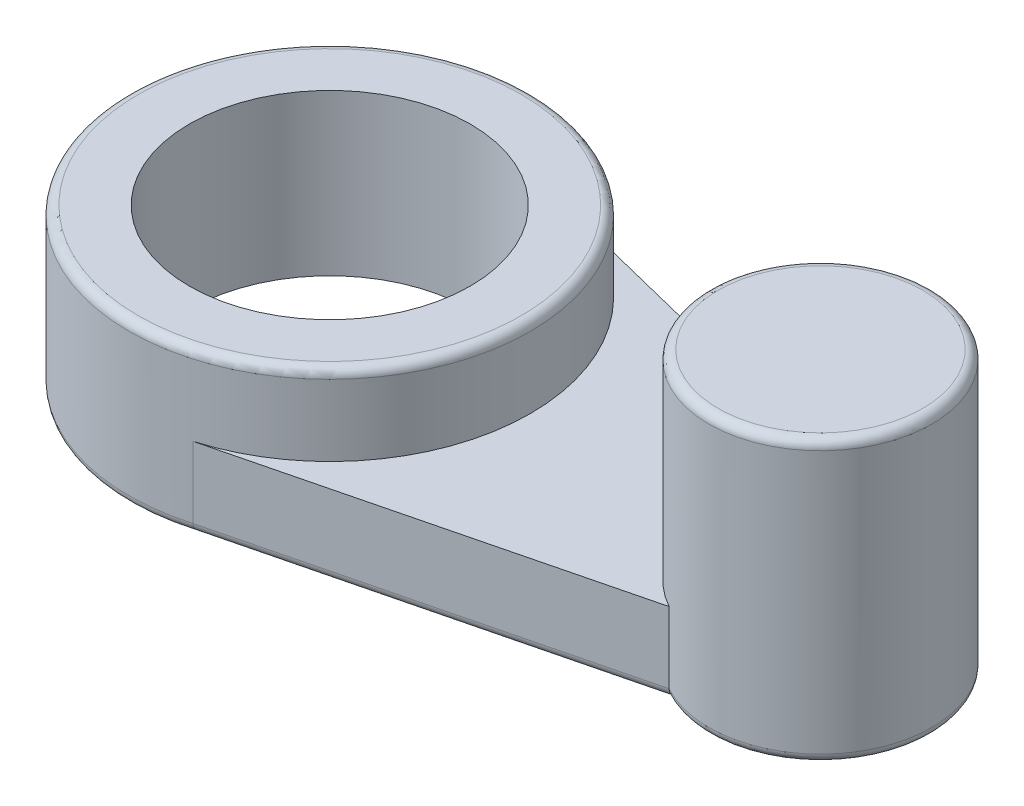
ISO-10303-21;
HEADER;
FILE_DESCRIPTION(('STEP AP214'),'2;1');
FILE_NAME('part.step','',(''),(''),'','','');
FILE_SCHEMA(('AUTOMOTIVE_DESIGN { 1 0 10303 214 1 1 1 1 }'));
ENDSEC;
DATA;
#1=APPLICATION_CONTEXT('core data for automotive mechanical design processes');
#2=APPLICATION_PROTOCOL_DEFINITION('international standard','automotive_design',2000,#1);
#3=PRODUCT_CONTEXT('',#1,'mechanical');
#4=PRODUCT('Part','Part','',(#3));
#5=PRODUCT_RELATED_PRODUCT_CATEGORY('part','',(#4));
#6=PRODUCT_DEFINITION_FORMATION('','',#4);
#7=PRODUCT_DEFINITION_CONTEXT('part definition',#1,'design');
#8=PRODUCT_DEFINITION('design','',#6,#7);
#9=PRODUCT_DEFINITION_SHAPE('','',#8);
#10=(LENGTH_UNIT() NAMED_UNIT(*) SI_UNIT(.MILLI.,.METRE.));
#11=(NAMED_UNIT(*) PLANE_ANGLE_UNIT() SI_UNIT($,.RADIAN.));
#12=(NAMED_UNIT(*) SI_UNIT($,.STERADIAN.) SOLID_ANGLE_UNIT());
#13=UNCERTAINTY_MEASURE_WITH_UNIT(LENGTH_MEASURE(1.E-05),#10,'distance_accuracy_value','');
#14=(GEOMETRIC_REPRESENTATION_CONTEXT(3) GLOBAL_UNCERTAINTY_ASSIGNED_CONTEXT((#13)) GLOBAL_UNIT_ASSIGNED_CONTEXT((#10,
#11,#12)) REPRESENTATION_CONTEXT('',''));
#15=CARTESIAN_POINT('',(0.,0.,0.));
#16=DIRECTION('',(0.,0.,1.));
#17=DIRECTION('',(1.,0.,0.));
#18=AXIS2_PLACEMENT_3D('',#15,#16,#17);
#19=CARTESIAN_POINT('',(-11.9959957868635,23.4129631518981,0.));
#20=DIRECTION('',(0.,-1.,0.));
#21=DIRECTION('',(0.,0.,-1.));
#22=AXIS2_PLACEMENT_3D('',#19,#20,#21);
#23=CYLINDRICAL_SURFACE('',#22,6.13214349395014);
#24=CARTESIAN_POINT('',(-11.9959957868635,33.9529631518981,0.));
#25=DIRECTION('',(0.,-1.,0.));
#26=DIRECTION('',(0.,0.,-1.));
#27=AXIS2_PLACEMENT_3D('',#24,#25,#26);
#28=CIRCLE('',#27,6.13214349395014);
#29=CARTESIAN_POINT('',(-11.9959957868635,33.9529631518981,-6.13214349395014));
#30=VERTEX_POINT('',#29);
#31=EDGE_CURVE('E137',#30,#30,#28,.T.);
#32=ORIENTED_EDGE('',*,*,#31,.T.);
#33=EDGE_LOOP('',(#32));
#34=FACE_BOUND('',#33,.T.);
#35=DIRECTION('',(0.,-1.,0.));
#36=VECTOR('',#35,1.);
#37=CARTESIAN_POINT('',(-14.9421293152847,23.4129631518981,5.37805550948547));
#38=LINE('',#37,#36);
#39=CARTESIAN_POINT('',(-14.9421293152847,23.4129631518981,5.37805550948547));
#40=VERTEX_POINT('',#39);
#41=CARTESIAN_POINT('',(-14.9421293152847,19.4969631518981,5.37805550948547));
#42=VERTEX_POINT('',#41);
#43=EDGE_CURVE('E116',#40,#42,#38,.T.);
#44=ORIENTED_EDGE('',*,*,#43,.T.);
#45=CARTESIAN_POINT('',(-11.9959957868635,19.4969631518981,0.));
#46=DIRECTION('',(0.,1.,0.));
#47=DIRECTION('',(0.,0.,1.));
#48=AXIS2_PLACEMENT_3D('',#45,#46,#47);
#49=CIRCLE('',#48,6.13214349395014);
#50=CARTESIAN_POINT('',(-14.9421293152847,19.4969631518981,-5.37805550948547));
#51=VERTEX_POINT('',#50);
#52=EDGE_CURVE('E114',#42,#51,#49,.T.);
#53=ORIENTED_EDGE('',*,*,#52,.T.);
#54=DIRECTION('',(0.,-1.,0.));
#55=VECTOR('',#54,1.);
#56=CARTESIAN_POINT('',(-14.9421293152847,23.4129631518981,-5.37805550948547));
#57=LINE('',#56,#55);
#58=CARTESIAN_POINT('',(-14.9421293152847,23.4129631518981,-5.37805550948547));
#59=VERTEX_POINT('',#58);
#60=EDGE_CURVE('E99',#59,#51,#57,.T.);
#61=ORIENTED_EDGE('',*,*,#60,.F.);
#62=CARTESIAN_POINT('',(-11.9959957868635,23.4129631518981,0.));
#63=DIRECTION('',(0.,1.,0.));
#64=DIRECTION('',(0.,0.,1.));
#65=AXIS2_PLACEMENT_3D('',#62,#63,#64);
#66=CIRCLE('',#65,6.13214349395013);
#67=EDGE_CURVE('E112',#59,#40,#66,.T.);
#68=ORIENTED_EDGE('',*,*,#67,.T.);
#69=EDGE_LOOP('',(#44,#53,#61,#68));
#70=FACE_BOUND('',#69,.T.);
#71=ADVANCED_FACE('F37',(#34,#70),#23,.T.);
#72=CARTESIAN_POINT('',(-17.8664003133708,23.4129631518981,-6.10644323168723));
#73=DIRECTION('',(0.241698542021081,0.,-0.970351387274158));
#74=DIRECTION('',(-0.970351387274158,0.,-0.241698542021081));
#75=AXIS2_PLACEMENT_3D('',#72,#73,#74);
#76=PLANE('',#75);
#77=ORIENTED_EDGE('',*,*,#60,.T.);
#78=DIRECTION('',(0.970351387274158,0.,0.241698542021081));
#79=VECTOR('',#78,1.);
#80=CARTESIAN_POINT('',(-35.9101707163184,19.4969631518981,-10.6008491305716));
#81=LINE('',#80,#79);
#82=CARTESIAN_POINT('',(-35.9101707163185,19.4969631518981,-10.6008491305716));
#83=VERTEX_POINT('',#82);
#84=EDGE_CURVE('E133',#51,#83,#81,.F.);
#85=ORIENTED_EDGE('',*,*,#84,.T.);
#86=DIRECTION('',(0.,-1.,0.));
#87=VECTOR('',#86,1.);
#88=CARTESIAN_POINT('',(-35.9101707163185,27.8289631518981,-10.6008491305716));
#89=LINE('',#88,#87);
#90=CARTESIAN_POINT('',(-35.9101707163184,23.4129631518981,-10.6008491305716));
#91=VERTEX_POINT('',#90);
#92=EDGE_CURVE('E102',#91,#83,#89,.T.);
#93=ORIENTED_EDGE('',*,*,#92,.F.);
#94=DIRECTION('',(0.970351387274158,0.,0.241698542021081));
#95=VECTOR('',#94,1.);
#96=CARTESIAN_POINT('',(-17.8664003133708,23.4129631518981,-6.10644323168723));
#97=LINE('',#96,#95);
#98=EDGE_CURVE('E95',#91,#59,#97,.T.);
#99=ORIENTED_EDGE('',*,*,#98,.T.);
#100=EDGE_LOOP('',(#77,#85,#93,#99));
#101=FACE_BOUND('',#100,.T.);
#102=ADVANCED_FACE('F97',(#101),#76,.T.);
#103=CARTESIAN_POINT('',(-38.9929612883262,23.4129631518981,0.));
#104=DIRECTION('',(0.,-1.,0.));
#105=DIRECTION('',(0.,0.,-1.));
#106=AXIS2_PLACEMENT_3D('',#103,#104,#105);
#107=CYLINDRICAL_SURFACE('',#106,11.04);
#108=CARTESIAN_POINT('',(-38.9929612883262,27.3289631518981,0.));
#109=DIRECTION('',(0.,-1.,0.));
#110=DIRECTION('',(0.,0.,-1.));
#111=AXIS2_PLACEMENT_3D('',#108,#109,#110);
#112=CIRCLE('',#111,11.04);
#113=CARTESIAN_POINT('',(-38.9929612883262,27.3289631518981,-11.04));
#114=VERTEX_POINT('',#113);
#115=EDGE_CURVE('E144',#114,#114,#112,.T.);
#116=ORIENTED_EDGE('',*,*,#115,.T.);
#117=EDGE_LOOP('',(#116));
#118=FACE_BOUND('',#117,.T.);
#119=ORIENTED_EDGE('',*,*,#92,.T.);
#120=CARTESIAN_POINT('',(-38.9929612883262,19.4969631518981,0.));
#121=DIRECTION('',(0.,1.,0.));
#122=DIRECTION('',(0.,0.,1.));
#123=AXIS2_PLACEMENT_3D('',#120,#121,#122);
#124=CIRCLE('',#123,11.04);
#125=CARTESIAN_POINT('',(-35.9101707163185,19.4969631518981,10.6008491305716));
#126=VERTEX_POINT('',#125);
#127=EDGE_CURVE('E150',#83,#126,#124,.T.);
#128=ORIENTED_EDGE('',*,*,#127,.T.);
#129=DIRECTION('',(0.,-1.,0.));
#130=VECTOR('',#129,1.);
#131=CARTESIAN_POINT('',(-35.9101707163185,27.8289631518981,10.6008491305716));
#132=LINE('',#131,#130);
#133=CARTESIAN_POINT('',(-35.9101707163184,23.4129631518981,10.6008491305716));
#134=VERTEX_POINT('',#133);
#135=EDGE_CURVE('E124',#134,#126,#132,.T.);
#136=ORIENTED_EDGE('',*,*,#135,.F.);
#137=CARTESIAN_POINT('',(-38.9929612883262,23.4129631518981,0.));
#138=DIRECTION('',(0.,1.,0.));
#139=DIRECTION('',(0.,0.,1.));
#140=AXIS2_PLACEMENT_3D('',#137,#138,#139);
#141=CIRCLE('',#140,11.04);
#142=EDGE_CURVE('E197',#134,#91,#141,.T.);
#143=ORIENTED_EDGE('',*,*,#142,.T.);
#144=EDGE_LOOP('',(#119,#128,#136,#143));
#145=FACE_BOUND('',#144,.T.);
#146=ADVANCED_FACE('F191',(#118,#145),#107,.T.);
#147=CARTESIAN_POINT('',(-17.8664003133708,23.4129631518981,6.10644323168723));
#148=DIRECTION('',(-0.241698542021081,0.,-0.970351387274158));
#149=DIRECTION('',(-0.970351387274158,0.,0.241698542021081));
#150=AXIS2_PLACEMENT_3D('',#147,#148,#149);
#151=PLANE('',#150);
#152=ORIENTED_EDGE('',*,*,#135,.T.);
#153=DIRECTION('',(0.970351387274158,0.,-0.241698542021081));
#154=VECTOR('',#153,1.);
#155=CARTESIAN_POINT('',(-17.8664003133708,19.4969631518981,6.10644323168723));
#156=LINE('',#155,#154);
#157=EDGE_CURVE('E135',#126,#42,#156,.T.);
#158=ORIENTED_EDGE('',*,*,#157,.T.);
#159=ORIENTED_EDGE('',*,*,#43,.F.);
#160=DIRECTION('',(0.970351387274158,0.,-0.241698542021081));
#161=VECTOR('',#160,1.);
#162=CARTESIAN_POINT('',(-17.8664003133708,23.4129631518981,6.10644323168723));
#163=LINE('',#162,#161);
#164=EDGE_CURVE('E106',#134,#40,#163,.T.);
#165=ORIENTED_EDGE('',*,*,#164,.F.);
#166=EDGE_LOOP('',(#152,#158,#159,#165));
#167=FACE_BOUND('',#166,.T.);
#168=ADVANCED_FACE('F196',(#167),#151,.F.);
#169=CARTESIAN_POINT('',(-38.9929612883262,23.4129631518981,0.));
#170=DIRECTION('',(0.,-1.,0.));
#171=DIRECTION('',(0.,0.,-1.));
#172=AXIS2_PLACEMENT_3D('',#169,#170,#171);
#173=CYLINDRICAL_SURFACE('',#172,7.728);
#174=CARTESIAN_POINT('',(-38.9929612883262,18.9969631518981,0.));
#175=DIRECTION('',(0.,1.,0.));
#176=DIRECTION('',(0.,0.,1.));
#177=AXIS2_PLACEMENT_3D('',#174,#175,#176);
#178=CIRCLE('',#177,7.728);
#179=CARTESIAN_POINT('',(-38.9929612883262,18.9969631518981,7.728));
#180=VERTEX_POINT('',#179);
#181=EDGE_CURVE('E107',#180,#180,#178,.T.);
#182=ORIENTED_EDGE('',*,*,#181,.F.);
#183=EDGE_LOOP('',(#182));
#184=FACE_BOUND('',#183,.T.);
#185=CARTESIAN_POINT('',(-38.9929612883262,27.8289631518981,0.));
#186=DIRECTION('',(0.,-1.,0.));
#187=DIRECTION('',(0.,0.,-1.));
#188=AXIS2_PLACEMENT_3D('',#185,#186,#187);
#189=CIRCLE('',#188,7.72800000000001);
#190=CARTESIAN_POINT('',(-38.9929612883262,27.8289631518981,-7.72800000000001));
#191=VERTEX_POINT('',#190);
#192=EDGE_CURVE('E203',#191,#191,#189,.T.);
#193=ORIENTED_EDGE('',*,*,#192,.F.);
#194=EDGE_LOOP('',(#193));
#195=FACE_BOUND('',#194,.T.);
#196=ADVANCED_FACE('F212',(#184,#195),#173,.F.);
#197=CARTESIAN_POINT('',(-19.3874147060841,23.4129631518981,0.));
#198=DIRECTION('',(0.,1.,0.));
#199=DIRECTION('',(0.,0.,1.));
#200=AXIS2_PLACEMENT_3D('',#197,#198,#199);
#201=PLANE('',#200);
#202=ORIENTED_EDGE('',*,*,#142,.F.);
#203=ORIENTED_EDGE('',*,*,#164,.T.);
#204=ORIENTED_EDGE('',*,*,#67,.F.);
#205=ORIENTED_EDGE('',*,*,#98,.F.);
#206=EDGE_LOOP('',(#202,#203,#204,#205));
#207=FACE_BOUND('',#206,.T.);
#208=ADVANCED_FACE('F118',(#207),#201,.T.);
#209=CARTESIAN_POINT('',(-19.3874147060841,18.9969631518981,0.));
#210=DIRECTION('',(0.,1.,0.));
#211=DIRECTION('',(0.,0.,1.));
#212=AXIS2_PLACEMENT_3D('',#209,#210,#211);
#213=PLANE('',#212);
#214=DIRECTION('',(0.970351387274158,0.,-0.241698542021081));
#215=VECTOR('',#214,1.);
#216=CARTESIAN_POINT('',(-17.9872495843814,18.9969631518981,5.62126753805015));
#217=LINE('',#216,#215);
#218=CARTESIAN_POINT('',(-14.8686441965292,18.9969631518981,4.84447432141917));
#219=VERTEX_POINT('',#218);
#220=CARTESIAN_POINT('',(-36.040563512861,18.9969631518981,10.1180505718951));
#221=VERTEX_POINT('',#220);
#222=EDGE_CURVE('E58',#219,#221,#217,.F.);
#223=ORIENTED_EDGE('',*,*,#222,.T.);
#224=CARTESIAN_POINT('',(-38.9929612883262,18.9969631518981,0.));
#225=DIRECTION('',(0.,1.,0.));
#226=DIRECTION('',(0.,0.,1.));
#227=AXIS2_PLACEMENT_3D('',#224,#225,#226);
#228=CIRCLE('',#227,10.54);
#229=CARTESIAN_POINT('',(-36.040563512861,18.9969631518981,-10.1180505718952));
#230=VERTEX_POINT('',#229);
#231=EDGE_CURVE('E185',#221,#230,#228,.F.);
#232=ORIENTED_EDGE('',*,*,#231,.T.);
#233=DIRECTION('',(0.970351387274158,0.,0.241698542021081));
#234=VECTOR('',#233,1.);
#235=CARTESIAN_POINT('',(-15.0629785862953,18.9969631518981,-4.8928798158484));
#236=LINE('',#235,#234);
#237=CARTESIAN_POINT('',(-14.8686441965292,18.9969631518981,-4.84447432141918));
#238=VERTEX_POINT('',#237);
#239=EDGE_CURVE('E65',#230,#238,#236,.T.);
#240=ORIENTED_EDGE('',*,*,#239,.T.);
#241=CARTESIAN_POINT('',(-11.9959957868635,18.9969631518981,0.));
#242=DIRECTION('',(0.,1.,0.));
#243=DIRECTION('',(0.,0.,1.));
#244=AXIS2_PLACEMENT_3D('',#241,#242,#243);
#245=CIRCLE('',#244,5.63214349395014);
#246=EDGE_CURVE('E115',#238,#219,#245,.F.);
#247=ORIENTED_EDGE('',*,*,#246,.T.);
#248=EDGE_LOOP('',(#223,#232,#240,#247));
#249=FACE_BOUND('',#248,.T.);
#250=ORIENTED_EDGE('',*,*,#181,.T.);
#251=EDGE_LOOP('',(#250));
#252=FACE_BOUND('',#251,.T.);
#253=ADVANCED_FACE('F205',(#249,#252),#213,.F.);
#254=CARTESIAN_POINT('',(-11.9959957868635,34.4529631518981,0.));
#255=DIRECTION('',(0.,-1.,0.));
#256=DIRECTION('',(0.,0.,-1.));
#257=AXIS2_PLACEMENT_3D('',#254,#255,#256);
#258=PLANE('',#257);
#259=CARTESIAN_POINT('',(-11.9959957868635,34.4529631518981,0.));
#260=DIRECTION('',(0.,-1.,0.));
#261=DIRECTION('',(0.,0.,-1.));
#262=AXIS2_PLACEMENT_3D('',#259,#260,#261);
#263=CIRCLE('',#262,5.63214349395014);
#264=CARTESIAN_POINT('',(-11.9959957868635,34.4529631518981,-5.63214349395014));
#265=VERTEX_POINT('',#264);
#266=EDGE_CURVE('E141',#265,#265,#263,.F.);
#267=ORIENTED_EDGE('',*,*,#266,.T.);
#268=EDGE_LOOP('',(#267));
#269=FACE_BOUND('',#268,.T.);
#270=ADVANCED_FACE('F208',(#269),#258,.F.);
#271=CARTESIAN_POINT('',(-38.9929612883262,27.8289631518981,0.));
#272=DIRECTION('',(0.,-1.,0.));
#273=DIRECTION('',(0.,0.,-1.));
#274=AXIS2_PLACEMENT_3D('',#271,#272,#273);
#275=PLANE('',#274);
#276=CARTESIAN_POINT('',(-38.9929612883262,27.8289631518981,0.));
#277=DIRECTION('',(0.,-1.,0.));
#278=DIRECTION('',(0.,0.,-1.));
#279=AXIS2_PLACEMENT_3D('',#276,#277,#278);
#280=CIRCLE('',#279,10.54);
#281=CARTESIAN_POINT('',(-38.9929612883262,27.8289631518981,-10.54));
#282=VERTEX_POINT('',#281);
#283=EDGE_CURVE('E147',#282,#282,#280,.F.);
#284=ORIENTED_EDGE('',*,*,#283,.T.);
#285=EDGE_LOOP('',(#284));
#286=FACE_BOUND('',#285,.T.);
#287=ORIENTED_EDGE('',*,*,#192,.T.);
#288=EDGE_LOOP('',(#287));
#289=FACE_BOUND('',#288,.T.);
#290=ADVANCED_FACE('F177',(#286,#289),#275,.F.);
#291=CARTESIAN_POINT('',(-17.9872495843814,19.4969631518981,5.62126753805015));
#292=DIRECTION('',(0.970351387274158,0.,-0.241698542021081));
#293=DIRECTION('',(-0.241698542021081,0.,-0.970351387274158));
#294=AXIS2_PLACEMENT_3D('',#291,#292,#293);
#295=CYLINDRICAL_SURFACE('',#294,0.5);
#296=ORIENTED_EDGE('',*,*,#157,.F.);
#297=CARTESIAN_POINT('',(-35.9101707163185,19.4969631518981,10.6008491305716));
#298=CARTESIAN_POINT('',(-35.9101645152855,19.4688389592666,10.6008722261111));
#299=CARTESIAN_POINT('',(-35.9107886454514,19.440721928932,10.5985591092982));
#300=CARTESIAN_POINT('',(-35.9132518992034,19.3853027745455,10.5894305452488));
#301=CARTESIAN_POINT('',(-35.9150901556804,19.3580000834397,10.5826183112084));
#302=CARTESIAN_POINT('',(-35.9199372763439,19.3049550987381,10.564656849425));
#303=CARTESIAN_POINT('',(-35.9229467023454,19.2792135608944,10.5535055402094));
#304=CARTESIAN_POINT('',(-35.9300481530671,19.2300408970086,10.5271936125944));
#305=CARTESIAN_POINT('',(-35.9341399025548,19.2066091856591,10.5120340134949));
#306=CARTESIAN_POINT('',(-35.9432910860418,19.1627136331812,10.4781331574344));
#307=CARTESIAN_POINT('',(-35.9483505217494,19.1422497972923,10.4593918941506));
#308=CARTESIAN_POINT('',(-35.9592964906778,19.1048621725398,10.4188505764742));
#309=CARTESIAN_POINT('',(-35.965183368491,19.0879398659096,10.397049247707));
#310=CARTESIAN_POINT('',(-35.977618410301,19.0581178071183,10.3510039142472));
#311=CARTESIAN_POINT('',(-35.9841669648904,19.0452204494951,10.3267584667935));
#312=CARTESIAN_POINT('',(-35.9977331694352,19.0238392752297,10.2765382719137));
#313=CARTESIAN_POINT('',(-36.0047502259477,19.0153499903215,10.2505657123505));
#314=CARTESIAN_POINT('',(-36.0156475198088,19.0059413533125,10.2102373208144));
#315=CARTESIAN_POINT('',(-36.0194337024368,19.0033417934835,10.1962266372921));
#316=CARTESIAN_POINT('',(-36.0270485799872,18.9994348366223,10.168050264231));
#317=CARTESIAN_POINT('',(-36.0308772189556,18.9981259055311,10.1538847789996));
#318=CARTESIAN_POINT('',(-36.0366619977869,18.9971305056127,10.1324835875125));
#319=CARTESIAN_POINT('',(-36.0386129272005,18.9969626826829,10.1252662904109));
#320=CARTESIAN_POINT('',(-36.040563512861,18.9969631518981,10.1180505718952));
#321=B_SPLINE_CURVE_WITH_KNOTS('',3,(#297,#298,#299,#300,#301,#302,#303,#304,#305,#306,#307,
#308,#309,#310,#311,#312,#313,#314,#315,#316,#317,#318,#319,#320),.UNSPECIFIED.,.F.,.F.,(4,2,2,
2,2,2,2,2,2,2,2,4),(0.,0.0842604497592894,0.168460787060122,0.252701565512898,0.336920942279963,
0.421140467725503,0.505395171318541,0.589699904904091,0.673899806117333,0.718085190014083,
0.762217991020712,0.784644342041857),.UNSPECIFIED.);
#322=EDGE_CURVE('E51',#126,#221,#321,.T.);
#323=ORIENTED_EDGE('',*,*,#322,.T.);
#324=ORIENTED_EDGE('',*,*,#222,.F.);
#325=CARTESIAN_POINT('',(-14.9421293152847,19.4969631518981,5.37805550948547));
#326=CARTESIAN_POINT('',(-14.942132414396,19.4702397058806,5.37808665234147));
#327=CARTESIAN_POINT('',(-14.9418347620113,19.4435341733236,5.37577633459494));
#328=CARTESIAN_POINT('',(-14.9406623908897,19.3909681460324,5.3667153748242));
#329=CARTESIAN_POINT('',(-14.9397891545153,19.3651056591979,5.35997613919286));
#330=CARTESIAN_POINT('',(-14.937490028429,19.3148945795701,5.34229923668067));
#331=CARTESIAN_POINT('',(-14.9360642344701,19.2905457253267,5.33136229722466));
#332=CARTESIAN_POINT('',(-14.9327009615045,19.2439724438483,5.30569963079664));
#333=CARTESIAN_POINT('',(-14.9307633290477,19.221748656438,5.29097276763296));
#334=CARTESIAN_POINT('',(-14.9263665735765,19.1793601971849,5.25777029763611));
#335=CARTESIAN_POINT('',(-14.9238945358943,19.1592692666195,5.23920246124084));
#336=CARTESIAN_POINT('',(-14.918524209504,19.1222815166439,5.19917401836872));
#337=CARTESIAN_POINT('',(-14.915625782621,19.1053857367192,5.17771247435199));
#338=CARTESIAN_POINT('',(-14.9092673428912,19.0740961343528,5.13103018011629));
#339=CARTESIAN_POINT('',(-14.9057830457651,19.0599370134079,5.10565561480322));
#340=CARTESIAN_POINT('',(-14.8984855504529,19.0358054009119,5.05302901618352));
#341=CARTESIAN_POINT('',(-14.8946722661009,19.0258340102185,5.02577649139355));
#342=CARTESIAN_POINT('',(-14.8873267491247,19.0112483051626,4.97381288448704));
#343=CARTESIAN_POINT('',(-14.8838244661816,19.0060983402533,4.94924506679531));
#344=CARTESIAN_POINT('',(-14.8766971594922,18.9990864040659,4.89969589503425));
#345=CARTESIAN_POINT('',(-14.8730723855781,18.9972181086181,4.87471543021781));
#346=CARTESIAN_POINT('',(-14.8691598616366,18.9969712503272,4.84799297083337));
#347=CARTESIAN_POINT('',(-14.868902097914,18.9969631324544,4.8462335593471));
#348=CARTESIAN_POINT('',(-14.8686441965291,18.9969631518981,4.84447432141922));
#349=B_SPLINE_CURVE_WITH_KNOTS('',3,(#325,#326,#327,#328,#329,#330,#331,#332,#333,#334,#335,
#336,#337,#338,#339,#340,#341,#342,#343,#344,#345,#346,#347,#348),.UNSPECIFIED.,.F.,.F.,(4,2,2,
2,2,2,2,2,2,2,2,4),(0.,0.080041315201751,0.159877292770921,0.239699441715084,0.319545548694535,
0.40159493425082,0.483670967368172,0.571093982668611,0.658539965103093,0.734370387591143,
0.810054514791419,0.815389062425867),.UNSPECIFIED.);
#350=EDGE_CURVE('E158',#42,#219,#349,.T.);
#351=ORIENTED_EDGE('',*,*,#350,.F.);
#352=EDGE_LOOP('',(#296,#323,#324,#351));
#353=FACE_BOUND('',#352,.T.);
#354=ADVANCED_FACE('F172',(#353),#295,.T.);
#355=CARTESIAN_POINT('',(-11.9959957868635,19.4969631518981,0.));
#356=DIRECTION('',(0.,1.,0.));
#357=DIRECTION('',(0.,0.,1.));
#358=AXIS2_PLACEMENT_3D('',#355,#356,#357);
#359=TOROIDAL_SURFACE('',#358,5.63214349395014,0.5);
#360=ORIENTED_EDGE('',*,*,#350,.T.);
#361=ORIENTED_EDGE('',*,*,#246,.F.);
#362=CARTESIAN_POINT('',(-14.9421293152847,19.4969631518981,-5.37805550948547));
#363=CARTESIAN_POINT('',(-14.942132414396,19.4702397058806,-5.37808665234148));
#364=CARTESIAN_POINT('',(-14.9418347620113,19.4435341733236,-5.37577633459494));
#365=CARTESIAN_POINT('',(-14.9406623908897,19.3909681460324,-5.3667153748242));
#366=CARTESIAN_POINT('',(-14.9397891545153,19.3651056591979,-5.35997613919286));
#367=CARTESIAN_POINT('',(-14.937490028429,19.3148945795701,-5.34229923668067));
#368=CARTESIAN_POINT('',(-14.9360642344701,19.2905457253267,-5.33136229722467));
#369=CARTESIAN_POINT('',(-14.9327009615045,19.2439724438483,-5.30569963079664));
#370=CARTESIAN_POINT('',(-14.9307633290477,19.221748656438,-5.29097276763297));
#371=CARTESIAN_POINT('',(-14.9263665735765,19.1793601971849,-5.25777029763612));
#372=CARTESIAN_POINT('',(-14.9238945358943,19.1592692666195,-5.23920246124084));
#373=CARTESIAN_POINT('',(-14.918524209504,19.1222815166439,-5.19917401836873));
#374=CARTESIAN_POINT('',(-14.915625782621,19.1053857367192,-5.17771247435199));
#375=CARTESIAN_POINT('',(-14.9092673428912,19.0740961343528,-5.13103018011629));
#376=CARTESIAN_POINT('',(-14.9057830457651,19.0599370134079,-5.10565561480322));
#377=CARTESIAN_POINT('',(-14.8984855504529,19.0358054009119,-5.05302901618352));
#378=CARTESIAN_POINT('',(-14.8946722661009,19.0258340102185,-5.02577649139356));
#379=CARTESIAN_POINT('',(-14.8873267491247,19.0112483051626,-4.97381288448705));
#380=CARTESIAN_POINT('',(-14.8838244661816,19.0060983402533,-4.94924506679532));
#381=CARTESIAN_POINT('',(-14.8766971594922,18.9990864040659,-4.89969589503426));
#382=CARTESIAN_POINT('',(-14.873072385578,18.9972181086181,-4.87471543021782));
#383=CARTESIAN_POINT('',(-14.8691598616366,18.9969712503272,-4.84799297083337));
#384=CARTESIAN_POINT('',(-14.868902097914,18.9969631324544,-4.84623355934711));
#385=CARTESIAN_POINT('',(-14.8686441965291,18.9969631518981,-4.84447432141923));
#386=B_SPLINE_CURVE_WITH_KNOTS('',3,(#362,#363,#364,#365,#366,#367,#368,#369,#370,#371,#372,
#373,#374,#375,#376,#377,#378,#379,#380,#381,#382,#383,#384,#385),.UNSPECIFIED.,.F.,.F.,(4,2,2,
2,2,2,2,2,2,2,2,4),(0.,0.080041315201751,0.159877292770921,0.239699441715087,0.31954554869454,
0.401594934250823,0.483670967368173,0.571093982668612,0.658539965103093,0.734370387591143,
0.810054514791419,0.815389062425867),.UNSPECIFIED.);
#387=EDGE_CURVE('E151',#51,#238,#386,.T.);
#388=ORIENTED_EDGE('',*,*,#387,.F.);
#389=ORIENTED_EDGE('',*,*,#52,.F.);
#390=EDGE_LOOP('',(#360,#361,#388,#389));
#391=FACE_BOUND('',#390,.T.);
#392=ADVANCED_FACE('F165',(#391),#359,.T.);
#393=CARTESIAN_POINT('',(-17.9872495843814,19.4969631518981,-5.62126753805016));
#394=DIRECTION('',(-0.970351387274158,0.,-0.241698542021081));
#395=DIRECTION('',(-0.241698542021081,0.,0.970351387274158));
#396=AXIS2_PLACEMENT_3D('',#393,#394,#395);
#397=CYLINDRICAL_SURFACE('',#396,0.5);
#398=ORIENTED_EDGE('',*,*,#239,.F.);
#399=CARTESIAN_POINT('',(-35.9101707163185,19.4969631518981,-10.6008491305716));
#400=CARTESIAN_POINT('',(-35.9101645152856,19.4688389592666,-10.6008722261111));
#401=CARTESIAN_POINT('',(-35.9107886454515,19.440721928932,-10.5985591092983));
#402=CARTESIAN_POINT('',(-35.9132518992035,19.3853027745455,-10.5894305452489));
#403=CARTESIAN_POINT('',(-35.9150901556805,19.3580000834397,-10.5826183112084));
#404=CARTESIAN_POINT('',(-35.919937276344,19.3049550987381,-10.564656849425));
#405=CARTESIAN_POINT('',(-35.9229467023455,19.2792135608944,-10.5535055402094));
#406=CARTESIAN_POINT('',(-35.9300481530672,19.2300408970086,-10.5271936125945));
#407=CARTESIAN_POINT('',(-35.9341399025547,19.2066091856591,-10.5120340134949));
#408=CARTESIAN_POINT('',(-35.9432910860417,19.1627136331812,-10.4781331574344));
#409=CARTESIAN_POINT('',(-35.9483505217495,19.1422497972923,-10.4593918941506));
#410=CARTESIAN_POINT('',(-35.9592964906779,19.1048621725398,-10.4188505764742));
#411=CARTESIAN_POINT('',(-35.9651833684911,19.0879398659096,-10.3970492477071));
#412=CARTESIAN_POINT('',(-35.9776184103011,19.0581178071183,-10.3510039142472));
#413=CARTESIAN_POINT('',(-35.9841669648904,19.0452204494951,-10.3267584667936));
#414=CARTESIAN_POINT('',(-35.9977331694352,19.0238392752297,-10.2765382719137));
#415=CARTESIAN_POINT('',(-36.0047502259478,19.0153499903215,-10.2505657123506));
#416=CARTESIAN_POINT('',(-36.0156475198089,19.0059413533126,-10.2102373208145));
#417=CARTESIAN_POINT('',(-36.0194337024369,19.0033417934835,-10.1962266372922));
#418=CARTESIAN_POINT('',(-36.0270485799872,18.9994348366223,-10.168050264231));
#419=CARTESIAN_POINT('',(-36.0308772189556,18.9981259055311,-10.1538847789997));
#420=CARTESIAN_POINT('',(-36.036661997787,18.9971305056127,-10.1324835875125));
#421=CARTESIAN_POINT('',(-36.0386129272005,18.9969626826829,-10.1252662904109));
#422=CARTESIAN_POINT('',(-36.040563512861,18.9969631518981,-10.1180505718953));
#423=B_SPLINE_CURVE_WITH_KNOTS('',3,(#399,#400,#401,#402,#403,#404,#405,#406,#407,#408,#409,
#410,#411,#412,#413,#414,#415,#416,#417,#418,#419,#420,#421,#422),.UNSPECIFIED.,.F.,.F.,(4,2,2,
2,2,2,2,2,2,2,2,4),(0.,0.0842604497592891,0.168460787060122,0.252701565512897,0.336920942279964,
0.421140467725502,0.505395171318537,0.589699904904092,0.673899806117332,0.718085190014074,
0.762217991020694,0.784644342041847),.UNSPECIFIED.);
#424=EDGE_CURVE('E11',#230,#83,#423,.F.);
#425=ORIENTED_EDGE('',*,*,#424,.T.);
#426=ORIENTED_EDGE('',*,*,#84,.F.);
#427=ORIENTED_EDGE('',*,*,#387,.T.);
#428=EDGE_LOOP('',(#398,#425,#426,#427));
#429=FACE_BOUND('',#428,.T.);
#430=ADVANCED_FACE('F168',(#429),#397,.T.);
#431=CARTESIAN_POINT('',(-11.9959957868635,33.9529631518981,0.));
#432=DIRECTION('',(0.,-1.,0.));
#433=DIRECTION('',(0.,0.,-1.));
#434=AXIS2_PLACEMENT_3D('',#431,#432,#433);
#435=TOROIDAL_SURFACE('',#434,5.63214349395014,0.5);
#436=ORIENTED_EDGE('',*,*,#266,.F.);
#437=EDGE_LOOP('',(#436));
#438=FACE_BOUND('',#437,.T.);
#439=ORIENTED_EDGE('',*,*,#31,.F.);
#440=EDGE_LOOP('',(#439));
#441=FACE_BOUND('',#440,.T.);
#442=ADVANCED_FACE('F171',(#438,#441),#435,.T.);
#443=CARTESIAN_POINT('',(-38.9929612883262,27.3289631518981,0.));
#444=DIRECTION('',(0.,-1.,0.));
#445=DIRECTION('',(0.,0.,-1.));
#446=AXIS2_PLACEMENT_3D('',#443,#444,#445);
#447=TOROIDAL_SURFACE('',#446,10.54,0.5);
#448=ORIENTED_EDGE('',*,*,#283,.F.);
#449=EDGE_LOOP('',(#448));
#450=FACE_BOUND('',#449,.T.);
#451=ORIENTED_EDGE('',*,*,#115,.F.);
#452=EDGE_LOOP('',(#451));
#453=FACE_BOUND('',#452,.T.);
#454=ADVANCED_FACE('F287',(#450,#453),#447,.T.);
#455=CARTESIAN_POINT('',(-38.9929612883262,19.4969631518981,0.));
#456=DIRECTION('',(0.,1.,0.));
#457=DIRECTION('',(0.,0.,1.));
#458=AXIS2_PLACEMENT_3D('',#455,#456,#457);
#459=TOROIDAL_SURFACE('',#458,10.54,0.5);
#460=ORIENTED_EDGE('',*,*,#424,.F.);
#461=ORIENTED_EDGE('',*,*,#231,.F.);
#462=ORIENTED_EDGE('',*,*,#322,.F.);
#463=ORIENTED_EDGE('',*,*,#127,.F.);
#464=EDGE_LOOP('',(#460,#461,#462,#463));
#465=FACE_BOUND('',#464,.T.);
#466=ADVANCED_FACE('F39',(#465),#459,.T.);
#467=CLOSED_SHELL('',(#71,#102,#146,#168,#196,#208,#253,#270,#290,#354,#392,#430,#442,#454,#466));
#468=MANIFOLD_SOLID_BREP('B2',#467);
#469=ADVANCED_BREP_SHAPE_REPRESENTATION('',(#18,#468),#14);
#470=SHAPE_DEFINITION_REPRESENTATION(#9,#469);
ENDSEC;
END-ISO-10303-21;
